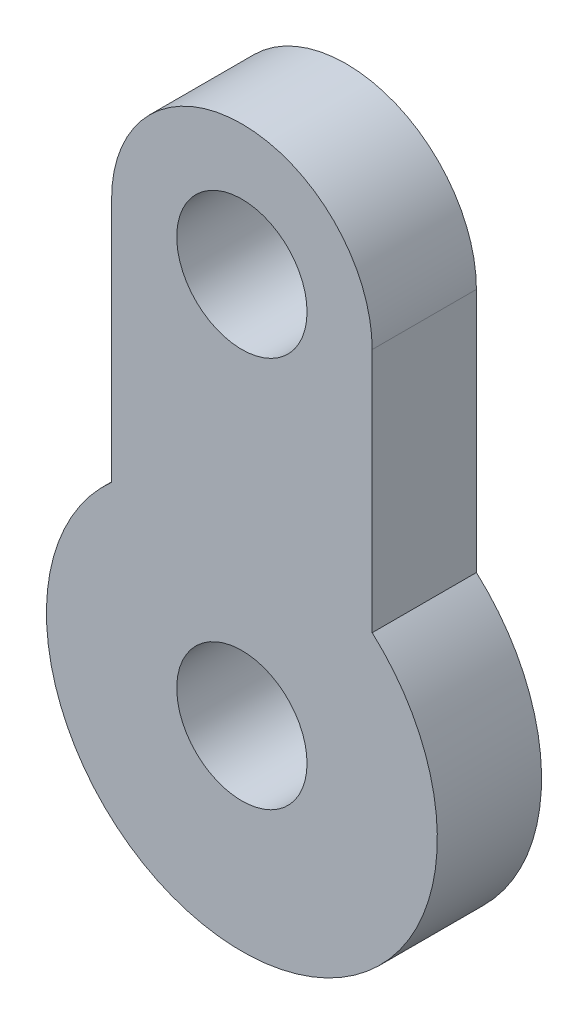
ISO-10303-21;
HEADER;
FILE_DESCRIPTION(('STEP AP214'),'2;1');
FILE_NAME('part.step','',(''),(''),'','','');
FILE_SCHEMA(('AUTOMOTIVE_DESIGN { 1 0 10303 214 1 1 1 1 }'));
ENDSEC;
DATA;
#1=APPLICATION_CONTEXT('core data for automotive mechanical design processes');
#2=APPLICATION_PROTOCOL_DEFINITION('international standard','automotive_design',2000,#1);
#3=PRODUCT_CONTEXT('',#1,'mechanical');
#4=PRODUCT('Part','Part','',(#3));
#5=PRODUCT_RELATED_PRODUCT_CATEGORY('part','',(#4));
#6=PRODUCT_DEFINITION_FORMATION('','',#4);
#7=PRODUCT_DEFINITION_CONTEXT('part definition',#1,'design');
#8=PRODUCT_DEFINITION('design','',#6,#7);
#9=PRODUCT_DEFINITION_SHAPE('','',#8);
#10=(LENGTH_UNIT() NAMED_UNIT(*) SI_UNIT(.MILLI.,.METRE.));
#11=(NAMED_UNIT(*) PLANE_ANGLE_UNIT() SI_UNIT($,.RADIAN.));
#12=(NAMED_UNIT(*) SI_UNIT($,.STERADIAN.) SOLID_ANGLE_UNIT());
#13=UNCERTAINTY_MEASURE_WITH_UNIT(LENGTH_MEASURE(1.E-05),#10,'distance_accuracy_value','');
#14=(GEOMETRIC_REPRESENTATION_CONTEXT(3) GLOBAL_UNCERTAINTY_ASSIGNED_CONTEXT((#13)) GLOBAL_UNIT_ASSIGNED_CONTEXT((#10,
#11,#12)) REPRESENTATION_CONTEXT('',''));
#15=CARTESIAN_POINT('',(0.,0.,0.));
#16=DIRECTION('',(0.,0.,1.));
#17=DIRECTION('',(1.,0.,0.));
#18=AXIS2_PLACEMENT_3D('',#15,#16,#17);
#19=CARTESIAN_POINT('',(0.,19.05,5.08));
#20=DIRECTION('',(0.,0.,-1.));
#21=DIRECTION('',(-1.,0.,0.));
#22=AXIS2_PLACEMENT_3D('',#19,#20,#21);
#23=PLANE('',#22);
#24=CARTESIAN_POINT('',(0.,19.05,5.08));
#25=DIRECTION('',(0.,0.,1.));
#26=DIRECTION('',(-1.,0.,0.));
#27=AXIS2_PLACEMENT_3D('',#24,#25,#26);
#28=CIRCLE('',#27,6.35);
#29=CARTESIAN_POINT('',(6.35,19.05,5.08));
#30=VERTEX_POINT('',#29);
#31=CARTESIAN_POINT('',(-6.35,19.05,5.08));
#32=VERTEX_POINT('',#31);
#33=EDGE_CURVE('E85',#30,#32,#28,.T.);
#34=ORIENTED_EDGE('',*,*,#33,.T.);
#35=DIRECTION('',(0.,-1.,0.));
#36=VECTOR('',#35,1.);
#37=CARTESIAN_POINT('',(-6.35,19.05,5.08));
#38=LINE('',#37,#36);
#39=CARTESIAN_POINT('',(-6.35,7.09951582856183,5.08));
#40=VERTEX_POINT('',#39);
#41=EDGE_CURVE('E80',#32,#40,#38,.T.);
#42=ORIENTED_EDGE('',*,*,#41,.T.);
#43=CARTESIAN_POINT('',(0.,0.,5.08));
#44=DIRECTION('',(0.,0.,1.));
#45=DIRECTION('',(1.,0.,0.));
#46=AXIS2_PLACEMENT_3D('',#43,#44,#45);
#47=CIRCLE('',#46,9.525);
#48=CARTESIAN_POINT('',(6.35,7.09951582856183,5.08));
#49=VERTEX_POINT('',#48);
#50=EDGE_CURVE('E83',#40,#49,#47,.T.);
#51=ORIENTED_EDGE('',*,*,#50,.T.);
#52=DIRECTION('',(0.,1.,0.));
#53=VECTOR('',#52,1.);
#54=CARTESIAN_POINT('',(6.35,19.05,5.08));
#55=LINE('',#54,#53);
#56=EDGE_CURVE('E50',#49,#30,#55,.T.);
#57=ORIENTED_EDGE('',*,*,#56,.T.);
#58=EDGE_LOOP('',(#34,#42,#51,#57));
#59=FACE_BOUND('',#58,.T.);
#60=CARTESIAN_POINT('',(0.,19.05,5.08));
#61=DIRECTION('',(0.,0.,1.));
#62=DIRECTION('',(1.,0.,0.));
#63=AXIS2_PLACEMENT_3D('',#60,#61,#62);
#64=CIRCLE('',#63,3.175);
#65=CARTESIAN_POINT('',(3.175,19.05,5.08));
#66=VERTEX_POINT('',#65);
#67=EDGE_CURVE('E100',#66,#66,#64,.T.);
#68=ORIENTED_EDGE('',*,*,#67,.F.);
#69=EDGE_LOOP('',(#68));
#70=FACE_BOUND('',#69,.T.);
#71=CARTESIAN_POINT('',(0.,0.,5.08));
#72=DIRECTION('',(0.,0.,1.));
#73=DIRECTION('',(1.,0.,0.));
#74=AXIS2_PLACEMENT_3D('',#71,#72,#73);
#75=CIRCLE('',#74,3.175);
#76=CARTESIAN_POINT('',(3.175,0.,5.08));
#77=VERTEX_POINT('',#76);
#78=EDGE_CURVE('E115',#77,#77,#75,.T.);
#79=ORIENTED_EDGE('',*,*,#78,.F.);
#80=EDGE_LOOP('',(#79));
#81=FACE_BOUND('',#80,.T.);
#82=ADVANCED_FACE('F33',(#59,#70,#81),#23,.F.);
#83=CARTESIAN_POINT('',(0.,19.05,0.));
#84=DIRECTION('',(0.,0.,-1.));
#85=DIRECTION('',(-1.,0.,0.));
#86=AXIS2_PLACEMENT_3D('',#83,#84,#85);
#87=PLANE('',#86);
#88=CARTESIAN_POINT('',(0.,19.05,0.));
#89=DIRECTION('',(0.,0.,1.));
#90=DIRECTION('',(1.,0.,0.));
#91=AXIS2_PLACEMENT_3D('',#88,#89,#90);
#92=CIRCLE('',#91,3.175);
#93=CARTESIAN_POINT('',(3.175,19.05,0.));
#94=VERTEX_POINT('',#93);
#95=EDGE_CURVE('E112',#94,#94,#92,.T.);
#96=ORIENTED_EDGE('',*,*,#95,.T.);
#97=EDGE_LOOP('',(#96));
#98=FACE_BOUND('',#97,.T.);
#99=CARTESIAN_POINT('',(0.,19.05,0.));
#100=DIRECTION('',(0.,0.,1.));
#101=DIRECTION('',(-1.,0.,0.));
#102=AXIS2_PLACEMENT_3D('',#99,#100,#101);
#103=CIRCLE('',#102,6.35);
#104=CARTESIAN_POINT('',(6.35,19.05,0.));
#105=VERTEX_POINT('',#104);
#106=CARTESIAN_POINT('',(-6.35,19.05,0.));
#107=VERTEX_POINT('',#106);
#108=EDGE_CURVE('E97',#105,#107,#103,.T.);
#109=ORIENTED_EDGE('',*,*,#108,.F.);
#110=DIRECTION('',(0.,1.,0.));
#111=VECTOR('',#110,1.);
#112=CARTESIAN_POINT('',(6.35,19.05,0.));
#113=LINE('',#112,#111);
#114=CARTESIAN_POINT('',(6.35,7.09951582856183,0.));
#115=VERTEX_POINT('',#114);
#116=EDGE_CURVE('E73',#115,#105,#113,.T.);
#117=ORIENTED_EDGE('',*,*,#116,.F.);
#118=CARTESIAN_POINT('',(0.,0.,0.));
#119=DIRECTION('',(0.,0.,1.));
#120=DIRECTION('',(1.,0.,0.));
#121=AXIS2_PLACEMENT_3D('',#118,#119,#120);
#122=CIRCLE('',#121,9.525);
#123=CARTESIAN_POINT('',(-6.35,7.09951582856183,0.));
#124=VERTEX_POINT('',#123);
#125=EDGE_CURVE('E67',#124,#115,#122,.T.);
#126=ORIENTED_EDGE('',*,*,#125,.F.);
#127=DIRECTION('',(0.,-1.,0.));
#128=VECTOR('',#127,1.);
#129=CARTESIAN_POINT('',(-6.35,19.05,0.));
#130=LINE('',#129,#128);
#131=EDGE_CURVE('E89',#107,#124,#130,.T.);
#132=ORIENTED_EDGE('',*,*,#131,.F.);
#133=EDGE_LOOP('',(#109,#117,#126,#132));
#134=FACE_BOUND('',#133,.T.);
#135=CARTESIAN_POINT('',(0.,0.,0.));
#136=DIRECTION('',(0.,0.,1.));
#137=DIRECTION('',(1.,0.,0.));
#138=AXIS2_PLACEMENT_3D('',#135,#136,#137);
#139=CIRCLE('',#138,3.175);
#140=CARTESIAN_POINT('',(3.175,0.,0.));
#141=VERTEX_POINT('',#140);
#142=EDGE_CURVE('E118',#141,#141,#139,.T.);
#143=ORIENTED_EDGE('',*,*,#142,.T.);
#144=EDGE_LOOP('',(#143));
#145=FACE_BOUND('',#144,.T.);
#146=ADVANCED_FACE('F108',(#98,#134,#145),#87,.T.);
#147=CARTESIAN_POINT('',(0.,19.05,5.08));
#148=DIRECTION('',(0.,0.,-1.));
#149=DIRECTION('',(-1.,0.,0.));
#150=AXIS2_PLACEMENT_3D('',#147,#148,#149);
#151=CYLINDRICAL_SURFACE('',#150,6.35);
#152=ORIENTED_EDGE('',*,*,#108,.T.);
#153=DIRECTION('',(0.,0.,-1.));
#154=VECTOR('',#153,1.);
#155=CARTESIAN_POINT('',(-6.35,19.05,5.08));
#156=LINE('',#155,#154);
#157=EDGE_CURVE('E11',#32,#107,#156,.T.);
#158=ORIENTED_EDGE('',*,*,#157,.F.);
#159=ORIENTED_EDGE('',*,*,#33,.F.);
#160=DIRECTION('',(0.,0.,-1.));
#161=VECTOR('',#160,1.);
#162=CARTESIAN_POINT('',(6.35,19.05,5.08));
#163=LINE('',#162,#161);
#164=EDGE_CURVE('E93',#30,#105,#163,.T.);
#165=ORIENTED_EDGE('',*,*,#164,.T.);
#166=EDGE_LOOP('',(#152,#158,#159,#165));
#167=FACE_BOUND('',#166,.T.);
#168=ADVANCED_FACE('F35',(#167),#151,.T.);
#169=CARTESIAN_POINT('',(-6.35,19.05,5.08));
#170=DIRECTION('',(1.,0.,0.));
#171=DIRECTION('',(0.,1.,0.));
#172=AXIS2_PLACEMENT_3D('',#169,#170,#171);
#173=PLANE('',#172);
#174=ORIENTED_EDGE('',*,*,#131,.T.);
#175=DIRECTION('',(0.,0.,-1.));
#176=VECTOR('',#175,1.);
#177=CARTESIAN_POINT('',(-6.35,7.09951582856183,5.08));
#178=LINE('',#177,#176);
#179=EDGE_CURVE('E42',#40,#124,#178,.T.);
#180=ORIENTED_EDGE('',*,*,#179,.F.);
#181=ORIENTED_EDGE('',*,*,#41,.F.);
#182=ORIENTED_EDGE('',*,*,#157,.T.);
#183=EDGE_LOOP('',(#174,#180,#181,#182));
#184=FACE_BOUND('',#183,.T.);
#185=ADVANCED_FACE('F88',(#184),#173,.F.);
#186=CARTESIAN_POINT('',(0.,0.,5.08));
#187=DIRECTION('',(0.,0.,-1.));
#188=DIRECTION('',(-1.,0.,0.));
#189=AXIS2_PLACEMENT_3D('',#186,#187,#188);
#190=CYLINDRICAL_SURFACE('',#189,9.525);
#191=ORIENTED_EDGE('',*,*,#125,.T.);
#192=DIRECTION('',(0.,0.,-1.));
#193=VECTOR('',#192,1.);
#194=CARTESIAN_POINT('',(6.35,7.09951582856183,5.08));
#195=LINE('',#194,#193);
#196=EDGE_CURVE('E90',#49,#115,#195,.T.);
#197=ORIENTED_EDGE('',*,*,#196,.F.);
#198=ORIENTED_EDGE('',*,*,#50,.F.);
#199=ORIENTED_EDGE('',*,*,#179,.T.);
#200=EDGE_LOOP('',(#191,#197,#198,#199));
#201=FACE_BOUND('',#200,.T.);
#202=ADVANCED_FACE('F91',(#201),#190,.T.);
#203=CARTESIAN_POINT('',(6.35,19.05,5.08));
#204=DIRECTION('',(-1.,0.,0.));
#205=DIRECTION('',(0.,-1.,0.));
#206=AXIS2_PLACEMENT_3D('',#203,#204,#205);
#207=PLANE('',#206);
#208=ORIENTED_EDGE('',*,*,#116,.T.);
#209=ORIENTED_EDGE('',*,*,#164,.F.);
#210=ORIENTED_EDGE('',*,*,#56,.F.);
#211=ORIENTED_EDGE('',*,*,#196,.T.);
#212=EDGE_LOOP('',(#208,#209,#210,#211));
#213=FACE_BOUND('',#212,.T.);
#214=ADVANCED_FACE('F105',(#213),#207,.F.);
#215=CARTESIAN_POINT('',(0.,19.05,5.08));
#216=DIRECTION('',(0.,0.,-1.));
#217=DIRECTION('',(-1.,0.,0.));
#218=AXIS2_PLACEMENT_3D('',#215,#216,#217);
#219=CYLINDRICAL_SURFACE('',#218,3.175);
#220=ORIENTED_EDGE('',*,*,#67,.T.);
#221=EDGE_LOOP('',(#220));
#222=FACE_BOUND('',#221,.T.);
#223=ORIENTED_EDGE('',*,*,#95,.F.);
#224=EDGE_LOOP('',(#223));
#225=FACE_BOUND('',#224,.T.);
#226=ADVANCED_FACE('F135',(#222,#225),#219,.F.);
#227=CARTESIAN_POINT('',(0.,0.,5.08));
#228=DIRECTION('',(0.,0.,-1.));
#229=DIRECTION('',(-1.,0.,0.));
#230=AXIS2_PLACEMENT_3D('',#227,#228,#229);
#231=CYLINDRICAL_SURFACE('',#230,3.175);
#232=ORIENTED_EDGE('',*,*,#78,.T.);
#233=EDGE_LOOP('',(#232));
#234=FACE_BOUND('',#233,.T.);
#235=ORIENTED_EDGE('',*,*,#142,.F.);
#236=EDGE_LOOP('',(#235));
#237=FACE_BOUND('',#236,.T.);
#238=ADVANCED_FACE('F124',(#234,#237),#231,.F.);
#239=CLOSED_SHELL('',(#82,#146,#168,#185,#202,#214,#226,#238));
#240=MANIFOLD_SOLID_BREP('B2',#239);
#241=ADVANCED_BREP_SHAPE_REPRESENTATION('',(#18,#240),#14);
#242=SHAPE_DEFINITION_REPRESENTATION(#9,#241);
ENDSEC;
END-ISO-10303-21;
